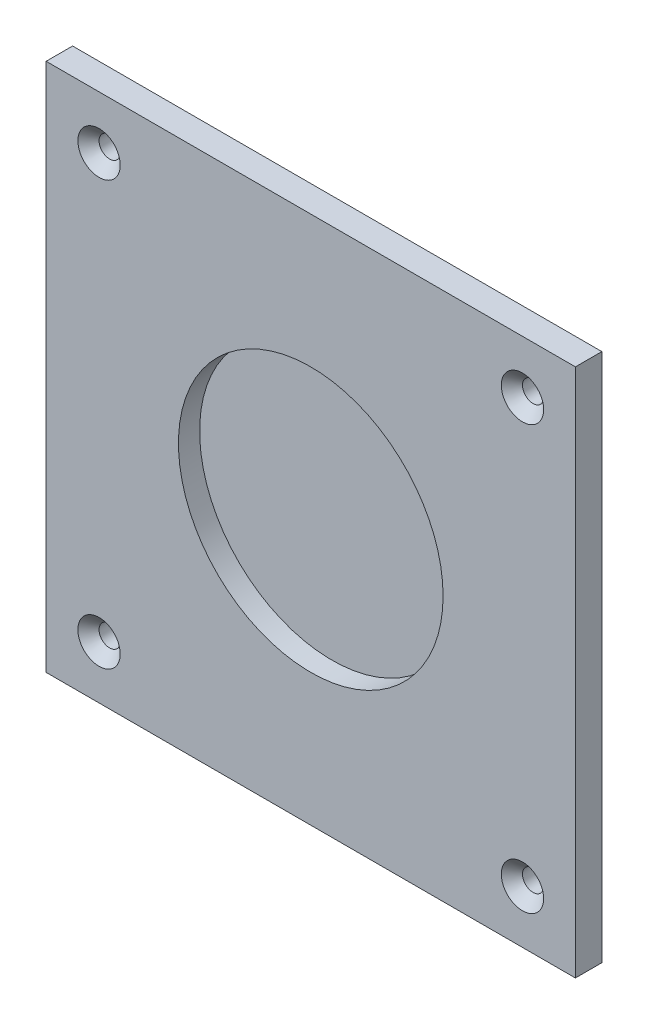
ISO-10303-21;
HEADER;
FILE_DESCRIPTION(('STEP AP214'),'2;1');
FILE_NAME('part.step','',(''),(''),'','','');
FILE_SCHEMA(('AUTOMOTIVE_DESIGN { 1 0 10303 214 1 1 1 1 }'));
ENDSEC;
DATA;
#1=APPLICATION_CONTEXT('core data for automotive mechanical design processes');
#2=APPLICATION_PROTOCOL_DEFINITION('international standard','automotive_design',2000,#1);
#3=PRODUCT_CONTEXT('',#1,'mechanical');
#4=PRODUCT('Part','Part','',(#3));
#5=PRODUCT_RELATED_PRODUCT_CATEGORY('part','',(#4));
#6=PRODUCT_DEFINITION_FORMATION('','',#4);
#7=PRODUCT_DEFINITION_CONTEXT('part definition',#1,'design');
#8=PRODUCT_DEFINITION('design','',#6,#7);
#9=PRODUCT_DEFINITION_SHAPE('','',#8);
#10=(LENGTH_UNIT() NAMED_UNIT(*) SI_UNIT(.MILLI.,.METRE.));
#11=(NAMED_UNIT(*) PLANE_ANGLE_UNIT() SI_UNIT($,.RADIAN.));
#12=(NAMED_UNIT(*) SI_UNIT($,.STERADIAN.) SOLID_ANGLE_UNIT());
#13=UNCERTAINTY_MEASURE_WITH_UNIT(LENGTH_MEASURE(1.E-05),#10,'distance_accuracy_value','');
#14=(GEOMETRIC_REPRESENTATION_CONTEXT(3) GLOBAL_UNCERTAINTY_ASSIGNED_CONTEXT((#13)) GLOBAL_UNIT_ASSIGNED_CONTEXT((#10,
#11,#12)) REPRESENTATION_CONTEXT('',''));
#15=CARTESIAN_POINT('',(0.,0.,0.));
#16=DIRECTION('',(0.,0.,1.));
#17=DIRECTION('',(1.,0.,0.));
#18=AXIS2_PLACEMENT_3D('',#15,#16,#17);
#19=CARTESIAN_POINT('',(-1270.,-1270.,-127.));
#20=DIRECTION('',(-1.,0.,0.));
#21=DIRECTION('',(0.,0.,1.));
#22=AXIS2_PLACEMENT_3D('',#19,#20,#21);
#23=PLANE('',#22);
#24=DIRECTION('',(0.,-1.,0.));
#25=VECTOR('',#24,1.);
#26=CARTESIAN_POINT('',(-1270.,-1270.,0.));
#27=LINE('',#26,#25);
#28=CARTESIAN_POINT('',(-1270.,1270.,0.));
#29=VERTEX_POINT('',#28);
#30=CARTESIAN_POINT('',(-1270.,-1270.,0.));
#31=VERTEX_POINT('',#30);
#32=EDGE_CURVE('E114',#29,#31,#27,.T.);
#33=ORIENTED_EDGE('',*,*,#32,.F.);
#34=DIRECTION('',(0.,0.,1.));
#35=VECTOR('',#34,1.);
#36=CARTESIAN_POINT('',(-1270.,1270.,-127.));
#37=LINE('',#36,#35);
#38=CARTESIAN_POINT('',(-1270.,1270.,-127.));
#39=VERTEX_POINT('',#38);
#40=EDGE_CURVE('E11',#39,#29,#37,.T.);
#41=ORIENTED_EDGE('',*,*,#40,.F.);
#42=DIRECTION('',(0.,-1.,0.));
#43=VECTOR('',#42,1.);
#44=CARTESIAN_POINT('',(-1270.,-1270.,-127.));
#45=LINE('',#44,#43);
#46=CARTESIAN_POINT('',(-1270.,-1270.,-127.));
#47=VERTEX_POINT('',#46);
#48=EDGE_CURVE('E105',#39,#47,#45,.T.);
#49=ORIENTED_EDGE('',*,*,#48,.T.);
#50=DIRECTION('',(0.,0.,1.));
#51=VECTOR('',#50,1.);
#52=CARTESIAN_POINT('',(-1270.,-1270.,-127.));
#53=LINE('',#52,#51);
#54=EDGE_CURVE('E46',#47,#31,#53,.T.);
#55=ORIENTED_EDGE('',*,*,#54,.T.);
#56=EDGE_LOOP('',(#33,#41,#49,#55));
#57=FACE_BOUND('',#56,.T.);
#58=ADVANCED_FACE('F43',(#57),#23,.T.);
#59=CARTESIAN_POINT('',(1270.,1270.,-127.));
#60=DIRECTION('',(0.,1.,0.));
#61=DIRECTION('',(-1.,0.,0.));
#62=AXIS2_PLACEMENT_3D('',#59,#60,#61);
#63=PLANE('',#62);
#64=DIRECTION('',(-1.,0.,0.));
#65=VECTOR('',#64,1.);
#66=CARTESIAN_POINT('',(1270.,1270.,0.));
#67=LINE('',#66,#65);
#68=CARTESIAN_POINT('',(1270.,1270.,0.));
#69=VERTEX_POINT('',#68);
#70=EDGE_CURVE('E108',#69,#29,#67,.T.);
#71=ORIENTED_EDGE('',*,*,#70,.F.);
#72=DIRECTION('',(0.,0.,1.));
#73=VECTOR('',#72,1.);
#74=CARTESIAN_POINT('',(1270.,1270.,-127.));
#75=LINE('',#74,#73);
#76=CARTESIAN_POINT('',(1270.,1270.,-127.));
#77=VERTEX_POINT('',#76);
#78=EDGE_CURVE('E53',#77,#69,#75,.T.);
#79=ORIENTED_EDGE('',*,*,#78,.F.);
#80=DIRECTION('',(-1.,0.,0.));
#81=VECTOR('',#80,1.);
#82=CARTESIAN_POINT('',(1270.,1270.,-127.));
#83=LINE('',#82,#81);
#84=EDGE_CURVE('E100',#77,#39,#83,.T.);
#85=ORIENTED_EDGE('',*,*,#84,.T.);
#86=ORIENTED_EDGE('',*,*,#40,.T.);
#87=EDGE_LOOP('',(#71,#79,#85,#86));
#88=FACE_BOUND('',#87,.T.);
#89=ADVANCED_FACE('F131',(#88),#63,.T.);
#90=CARTESIAN_POINT('',(1270.,-1270.,-127.));
#91=DIRECTION('',(1.,0.,0.));
#92=DIRECTION('',(0.,0.,-1.));
#93=AXIS2_PLACEMENT_3D('',#90,#91,#92);
#94=PLANE('',#93);
#95=DIRECTION('',(0.,1.,0.));
#96=VECTOR('',#95,1.);
#97=CARTESIAN_POINT('',(1270.,-1270.,0.));
#98=LINE('',#97,#96);
#99=CARTESIAN_POINT('',(1270.,-1270.,0.));
#100=VERTEX_POINT('',#99);
#101=EDGE_CURVE('E94',#100,#69,#98,.T.);
#102=ORIENTED_EDGE('',*,*,#101,.F.);
#103=DIRECTION('',(0.,0.,1.));
#104=VECTOR('',#103,1.);
#105=CARTESIAN_POINT('',(1270.,-1270.,-127.));
#106=LINE('',#105,#104);
#107=CARTESIAN_POINT('',(1270.,-1270.,-127.));
#108=VERTEX_POINT('',#107);
#109=EDGE_CURVE('E89',#108,#100,#106,.T.);
#110=ORIENTED_EDGE('',*,*,#109,.F.);
#111=DIRECTION('',(0.,1.,0.));
#112=VECTOR('',#111,1.);
#113=CARTESIAN_POINT('',(1270.,-1270.,-127.));
#114=LINE('',#113,#112);
#115=EDGE_CURVE('E92',#108,#77,#114,.T.);
#116=ORIENTED_EDGE('',*,*,#115,.T.);
#117=ORIENTED_EDGE('',*,*,#78,.T.);
#118=EDGE_LOOP('',(#102,#110,#116,#117));
#119=FACE_BOUND('',#118,.T.);
#120=ADVANCED_FACE('F91',(#119),#94,.T.);
#121=CARTESIAN_POINT('',(1270.,-1270.,-127.));
#122=DIRECTION('',(0.,-1.,0.));
#123=DIRECTION('',(1.,0.,0.));
#124=AXIS2_PLACEMENT_3D('',#121,#122,#123);
#125=PLANE('',#124);
#126=DIRECTION('',(1.,0.,0.));
#127=VECTOR('',#126,1.);
#128=CARTESIAN_POINT('',(1270.,-1270.,0.));
#129=LINE('',#128,#127);
#130=EDGE_CURVE('E118',#31,#100,#129,.T.);
#131=ORIENTED_EDGE('',*,*,#130,.F.);
#132=ORIENTED_EDGE('',*,*,#54,.F.);
#133=DIRECTION('',(1.,0.,0.));
#134=VECTOR('',#133,1.);
#135=CARTESIAN_POINT('',(1270.,-1270.,-127.));
#136=LINE('',#135,#134);
#137=EDGE_CURVE('E99',#47,#108,#136,.T.);
#138=ORIENTED_EDGE('',*,*,#137,.T.);
#139=ORIENTED_EDGE('',*,*,#109,.T.);
#140=EDGE_LOOP('',(#131,#132,#138,#139));
#141=FACE_BOUND('',#140,.T.);
#142=ADVANCED_FACE('F103',(#141),#125,.T.);
#143=CARTESIAN_POINT('',(0.,0.,-127.));
#144=DIRECTION('',(0.,0.,1.));
#145=DIRECTION('',(1.,0.,0.));
#146=AXIS2_PLACEMENT_3D('',#143,#144,#145);
#147=PLANE('',#146);
#148=CARTESIAN_POINT('',(1016.00000000001,-1015.99999999999,-127.));
#149=DIRECTION('',(0.,0.,-1.));
#150=DIRECTION('',(0.,1.,0.));
#151=AXIS2_PLACEMENT_3D('',#148,#149,#150);
#152=CIRCLE('',#151,50.8000000000002);
#153=CARTESIAN_POINT('',(1016.00000000001,-965.199999999989,-127.));
#154=VERTEX_POINT('',#153);
#155=EDGE_CURVE('E199',#154,#154,#152,.T.);
#156=ORIENTED_EDGE('',*,*,#155,.F.);
#157=EDGE_LOOP('',(#156));
#158=FACE_BOUND('',#157,.T.);
#159=CARTESIAN_POINT('',(-1016.,-1016.,-127.));
#160=DIRECTION('',(0.,0.,-1.));
#161=DIRECTION('',(1.,0.,0.));
#162=AXIS2_PLACEMENT_3D('',#159,#160,#161);
#163=CIRCLE('',#162,50.8000000000002);
#164=CARTESIAN_POINT('',(-965.2,-1016.,-127.));
#165=VERTEX_POINT('',#164);
#166=EDGE_CURVE('E209',#165,#165,#163,.T.);
#167=ORIENTED_EDGE('',*,*,#166,.F.);
#168=EDGE_LOOP('',(#167));
#169=FACE_BOUND('',#168,.T.);
#170=CARTESIAN_POINT('',(-1016.,1016.,-127.));
#171=DIRECTION('',(0.,0.,-1.));
#172=DIRECTION('',(0.,-1.,0.));
#173=AXIS2_PLACEMENT_3D('',#170,#171,#172);
#174=CIRCLE('',#173,50.8000000000002);
#175=CARTESIAN_POINT('',(-1016.,965.199999999996,-127.));
#176=VERTEX_POINT('',#175);
#177=EDGE_CURVE('E221',#176,#176,#174,.T.);
#178=ORIENTED_EDGE('',*,*,#177,.F.);
#179=EDGE_LOOP('',(#178));
#180=FACE_BOUND('',#179,.T.);
#181=CARTESIAN_POINT('',(1016.,1016.,-127.));
#182=DIRECTION('',(0.,0.,-1.));
#183=DIRECTION('',(-1.,0.,0.));
#184=AXIS2_PLACEMENT_3D('',#181,#182,#183);
#185=CIRCLE('',#184,50.8000000000002);
#186=CARTESIAN_POINT('',(965.2,1016.,-127.));
#187=VERTEX_POINT('',#186);
#188=EDGE_CURVE('E233',#187,#187,#185,.T.);
#189=ORIENTED_EDGE('',*,*,#188,.F.);
#190=EDGE_LOOP('',(#189));
#191=FACE_BOUND('',#190,.T.);
#192=ORIENTED_EDGE('',*,*,#48,.F.);
#193=ORIENTED_EDGE('',*,*,#84,.F.);
#194=ORIENTED_EDGE('',*,*,#115,.F.);
#195=ORIENTED_EDGE('',*,*,#137,.F.);
#196=EDGE_LOOP('',(#192,#193,#194,#195));
#197=FACE_BOUND('',#196,.T.);
#198=ADVANCED_FACE('F98',(#158,#169,#180,#191,#197),#147,.F.);
#199=CARTESIAN_POINT('',(0.,0.,0.));
#200=DIRECTION('',(0.,0.,1.));
#201=DIRECTION('',(1.,0.,0.));
#202=AXIS2_PLACEMENT_3D('',#199,#200,#201);
#203=PLANE('',#202);
#204=CARTESIAN_POINT('',(1016.00000000001,-1015.99999999999,0.));
#205=DIRECTION('',(0.,0.,-1.));
#206=DIRECTION('',(0.,1.,0.));
#207=AXIS2_PLACEMENT_3D('',#204,#205,#206);
#208=CIRCLE('',#207,101.6);
#209=CARTESIAN_POINT('',(1016.00000000001,-914.399999999989,0.));
#210=VERTEX_POINT('',#209);
#211=EDGE_CURVE('E203',#210,#210,#208,.T.);
#212=ORIENTED_EDGE('',*,*,#211,.T.);
#213=EDGE_LOOP('',(#212));
#214=FACE_BOUND('',#213,.T.);
#215=CARTESIAN_POINT('',(-1016.,-1016.,0.));
#216=DIRECTION('',(0.,0.,-1.));
#217=DIRECTION('',(1.,0.,0.));
#218=AXIS2_PLACEMENT_3D('',#215,#216,#217);
#219=CIRCLE('',#218,101.6);
#220=CARTESIAN_POINT('',(-914.4,-1016.,0.));
#221=VERTEX_POINT('',#220);
#222=EDGE_CURVE('E217',#221,#221,#219,.T.);
#223=ORIENTED_EDGE('',*,*,#222,.T.);
#224=EDGE_LOOP('',(#223));
#225=FACE_BOUND('',#224,.T.);
#226=CARTESIAN_POINT('',(-1016.,1016.,0.));
#227=DIRECTION('',(0.,0.,-1.));
#228=DIRECTION('',(0.,-1.,0.));
#229=AXIS2_PLACEMENT_3D('',#226,#227,#228);
#230=CIRCLE('',#229,101.6);
#231=CARTESIAN_POINT('',(-1016.,914.399999999997,0.));
#232=VERTEX_POINT('',#231);
#233=EDGE_CURVE('E229',#232,#232,#230,.T.);
#234=ORIENTED_EDGE('',*,*,#233,.T.);
#235=EDGE_LOOP('',(#234));
#236=FACE_BOUND('',#235,.T.);
#237=CARTESIAN_POINT('',(1016.,1016.,0.));
#238=DIRECTION('',(0.,0.,-1.));
#239=DIRECTION('',(-1.,0.,0.));
#240=AXIS2_PLACEMENT_3D('',#237,#238,#239);
#241=CIRCLE('',#240,101.6);
#242=CARTESIAN_POINT('',(914.4,1016.,0.));
#243=VERTEX_POINT('',#242);
#244=EDGE_CURVE('E241',#243,#243,#241,.T.);
#245=ORIENTED_EDGE('',*,*,#244,.T.);
#246=EDGE_LOOP('',(#245));
#247=FACE_BOUND('',#246,.T.);
#248=CARTESIAN_POINT('',(0.,0.,0.));
#249=DIRECTION('',(0.,0.,1.));
#250=DIRECTION('',(1.,0.,0.));
#251=AXIS2_PLACEMENT_3D('',#248,#249,#250);
#252=CIRCLE('',#251,635.);
#253=CARTESIAN_POINT('',(635.,0.,0.));
#254=VERTEX_POINT('',#253);
#255=EDGE_CURVE('E245',#254,#254,#252,.T.);
#256=ORIENTED_EDGE('',*,*,#255,.F.);
#257=EDGE_LOOP('',(#256));
#258=FACE_BOUND('',#257,.T.);
#259=ORIENTED_EDGE('',*,*,#32,.T.);
#260=ORIENTED_EDGE('',*,*,#130,.T.);
#261=ORIENTED_EDGE('',*,*,#101,.T.);
#262=ORIENTED_EDGE('',*,*,#70,.T.);
#263=EDGE_LOOP('',(#259,#260,#261,#262));
#264=FACE_BOUND('',#263,.T.);
#265=ADVANCED_FACE('F130',(#214,#225,#236,#247,#258,#264),#203,.T.);
#266=CARTESIAN_POINT('',(0.,0.,-101.6));
#267=DIRECTION('',(0.,0.,1.));
#268=DIRECTION('',(1.,0.,0.));
#269=AXIS2_PLACEMENT_3D('',#266,#267,#268);
#270=CYLINDRICAL_SURFACE('',#269,635.);
#271=CARTESIAN_POINT('',(0.,0.,-101.6));
#272=DIRECTION('',(0.,0.,1.));
#273=DIRECTION('',(1.,0.,0.));
#274=AXIS2_PLACEMENT_3D('',#271,#272,#273);
#275=CIRCLE('',#274,635.);
#276=CARTESIAN_POINT('',(635.,0.,-101.6));
#277=VERTEX_POINT('',#276);
#278=EDGE_CURVE('E119',#277,#277,#275,.T.);
#279=ORIENTED_EDGE('',*,*,#278,.F.);
#280=EDGE_LOOP('',(#279));
#281=FACE_BOUND('',#280,.T.);
#282=ORIENTED_EDGE('',*,*,#255,.T.);
#283=EDGE_LOOP('',(#282));
#284=FACE_BOUND('',#283,.T.);
#285=ADVANCED_FACE('F149',(#281,#284),#270,.F.);
#286=CARTESIAN_POINT('',(0.,0.,-101.6));
#287=DIRECTION('',(0.,0.,1.));
#288=DIRECTION('',(1.,0.,0.));
#289=AXIS2_PLACEMENT_3D('',#286,#287,#288);
#290=PLANE('',#289);
#291=ORIENTED_EDGE('',*,*,#278,.T.);
#292=EDGE_LOOP('',(#291));
#293=FACE_BOUND('',#292,.T.);
#294=ADVANCED_FACE('F156',(#293),#290,.T.);
#295=CARTESIAN_POINT('',(1016.,1016.,-50.7999999999996));
#296=DIRECTION('',(0.,0.,1.));
#297=DIRECTION('',(1.,0.,0.));
#298=AXIS2_PLACEMENT_3D('',#295,#296,#297);
#299=CONICAL_SURFACE('',#298,50.8000000000002,0.78539816339745);
#300=ORIENTED_EDGE('',*,*,#244,.F.);
#301=EDGE_LOOP('',(#300));
#302=FACE_BOUND('',#301,.T.);
#303=CARTESIAN_POINT('',(1016.,1016.,-50.7999999999996));
#304=DIRECTION('',(0.,0.,-1.));
#305=DIRECTION('',(-1.,0.,0.));
#306=AXIS2_PLACEMENT_3D('',#303,#304,#305);
#307=CIRCLE('',#306,50.8000000000002);
#308=CARTESIAN_POINT('',(965.2,1016.,-50.7999999999996));
#309=VERTEX_POINT('',#308);
#310=EDGE_CURVE('E237',#309,#309,#307,.T.);
#311=ORIENTED_EDGE('',*,*,#310,.T.);
#312=EDGE_LOOP('',(#311));
#313=FACE_BOUND('',#312,.T.);
#314=ADVANCED_FACE('F160',(#302,#313),#299,.F.);
#315=CARTESIAN_POINT('',(1016.,1016.,-127.));
#316=DIRECTION('',(0.,0.,-1.));
#317=DIRECTION('',(-1.,0.,0.));
#318=AXIS2_PLACEMENT_3D('',#315,#316,#317);
#319=CYLINDRICAL_SURFACE('',#318,50.8000000000002);
#320=ORIENTED_EDGE('',*,*,#310,.F.);
#321=EDGE_LOOP('',(#320));
#322=FACE_BOUND('',#321,.T.);
#323=ORIENTED_EDGE('',*,*,#188,.T.);
#324=EDGE_LOOP('',(#323));
#325=FACE_BOUND('',#324,.T.);
#326=ADVANCED_FACE('F164',(#322,#325),#319,.F.);
#327=CARTESIAN_POINT('',(-1016.,1016.,-50.7999999999996));
#328=DIRECTION('',(0.,0.,1.));
#329=DIRECTION('',(0.,1.,0.));
#330=AXIS2_PLACEMENT_3D('',#327,#328,#329);
#331=CONICAL_SURFACE('',#330,50.8000000000002,0.78539816339745);
#332=ORIENTED_EDGE('',*,*,#233,.F.);
#333=EDGE_LOOP('',(#332));
#334=FACE_BOUND('',#333,.T.);
#335=CARTESIAN_POINT('',(-1016.,1016.,-50.7999999999996));
#336=DIRECTION('',(0.,0.,-1.));
#337=DIRECTION('',(0.,-1.,0.));
#338=AXIS2_PLACEMENT_3D('',#335,#336,#337);
#339=CIRCLE('',#338,50.8000000000002);
#340=CARTESIAN_POINT('',(-1016.,965.199999999996,-50.7999999999996));
#341=VERTEX_POINT('',#340);
#342=EDGE_CURVE('E225',#341,#341,#339,.T.);
#343=ORIENTED_EDGE('',*,*,#342,.T.);
#344=EDGE_LOOP('',(#343));
#345=FACE_BOUND('',#344,.T.);
#346=ADVANCED_FACE('F168',(#334,#345),#331,.F.);
#347=CARTESIAN_POINT('',(-1016.,1016.,-127.));
#348=DIRECTION('',(0.,0.,-1.));
#349=DIRECTION('',(0.,-1.,0.));
#350=AXIS2_PLACEMENT_3D('',#347,#348,#349);
#351=CYLINDRICAL_SURFACE('',#350,50.8000000000002);
#352=ORIENTED_EDGE('',*,*,#342,.F.);
#353=EDGE_LOOP('',(#352));
#354=FACE_BOUND('',#353,.T.);
#355=ORIENTED_EDGE('',*,*,#177,.T.);
#356=EDGE_LOOP('',(#355));
#357=FACE_BOUND('',#356,.T.);
#358=ADVANCED_FACE('F172',(#354,#357),#351,.F.);
#359=CARTESIAN_POINT('',(-1016.,-1016.,-50.7999999999996));
#360=DIRECTION('',(0.,0.,1.));
#361=DIRECTION('',(-1.,0.,0.));
#362=AXIS2_PLACEMENT_3D('',#359,#360,#361);
#363=CONICAL_SURFACE('',#362,50.8000000000002,0.78539816339745);
#364=ORIENTED_EDGE('',*,*,#222,.F.);
#365=EDGE_LOOP('',(#364));
#366=FACE_BOUND('',#365,.T.);
#367=CARTESIAN_POINT('',(-1016.,-1016.,-50.7999999999996));
#368=DIRECTION('',(0.,0.,-1.));
#369=DIRECTION('',(1.,0.,0.));
#370=AXIS2_PLACEMENT_3D('',#367,#368,#369);
#371=CIRCLE('',#370,50.8000000000002);
#372=CARTESIAN_POINT('',(-965.2,-1016.,-50.7999999999996));
#373=VERTEX_POINT('',#372);
#374=EDGE_CURVE('E213',#373,#373,#371,.T.);
#375=ORIENTED_EDGE('',*,*,#374,.T.);
#376=EDGE_LOOP('',(#375));
#377=FACE_BOUND('',#376,.T.);
#378=ADVANCED_FACE('F176',(#366,#377),#363,.F.);
#379=CARTESIAN_POINT('',(-1016.,-1016.,-127.));
#380=DIRECTION('',(0.,0.,-1.));
#381=DIRECTION('',(1.,0.,0.));
#382=AXIS2_PLACEMENT_3D('',#379,#380,#381);
#383=CYLINDRICAL_SURFACE('',#382,50.8000000000002);
#384=ORIENTED_EDGE('',*,*,#374,.F.);
#385=EDGE_LOOP('',(#384));
#386=FACE_BOUND('',#385,.T.);
#387=ORIENTED_EDGE('',*,*,#166,.T.);
#388=EDGE_LOOP('',(#387));
#389=FACE_BOUND('',#388,.T.);
#390=ADVANCED_FACE('F180',(#386,#389),#383,.F.);
#391=CARTESIAN_POINT('',(1016.00000000001,-1015.99999999999,-50.7999999999996));
#392=DIRECTION('',(0.,0.,1.));
#393=DIRECTION('',(0.,-1.,0.));
#394=AXIS2_PLACEMENT_3D('',#391,#392,#393);
#395=CONICAL_SURFACE('',#394,50.8000000000002,0.78539816339745);
#396=ORIENTED_EDGE('',*,*,#211,.F.);
#397=EDGE_LOOP('',(#396));
#398=FACE_BOUND('',#397,.T.);
#399=CARTESIAN_POINT('',(1016.00000000001,-1015.99999999999,-50.7999999999996));
#400=DIRECTION('',(0.,0.,-1.));
#401=DIRECTION('',(0.,1.,0.));
#402=AXIS2_PLACEMENT_3D('',#399,#400,#401);
#403=CIRCLE('',#402,50.8000000000002);
#404=CARTESIAN_POINT('',(1016.00000000001,-965.199999999989,-50.7999999999996));
#405=VERTEX_POINT('',#404);
#406=EDGE_CURVE('E197',#405,#405,#403,.T.);
#407=ORIENTED_EDGE('',*,*,#406,.T.);
#408=EDGE_LOOP('',(#407));
#409=FACE_BOUND('',#408,.T.);
#410=ADVANCED_FACE('F184',(#398,#409),#395,.F.);
#411=CARTESIAN_POINT('',(1016.00000000001,-1015.99999999999,-127.));
#412=DIRECTION('',(0.,0.,-1.));
#413=DIRECTION('',(0.,1.,0.));
#414=AXIS2_PLACEMENT_3D('',#411,#412,#413);
#415=CYLINDRICAL_SURFACE('',#414,50.8000000000002);
#416=ORIENTED_EDGE('',*,*,#406,.F.);
#417=EDGE_LOOP('',(#416));
#418=FACE_BOUND('',#417,.T.);
#419=ORIENTED_EDGE('',*,*,#155,.T.);
#420=EDGE_LOOP('',(#419));
#421=FACE_BOUND('',#420,.T.);
#422=ADVANCED_FACE('F188',(#418,#421),#415,.F.);
#423=CLOSED_SHELL('',(#58,#89,#120,#142,#198,#265,#285,#294,#314,#326,#346,#358,#378,#390,#410,#422));
#424=MANIFOLD_SOLID_BREP('B2',#423);
#425=ADVANCED_BREP_SHAPE_REPRESENTATION('',(#18,#424),#14);
#426=SHAPE_DEFINITION_REPRESENTATION(#9,#425);
ENDSEC;
END-ISO-10303-21;
